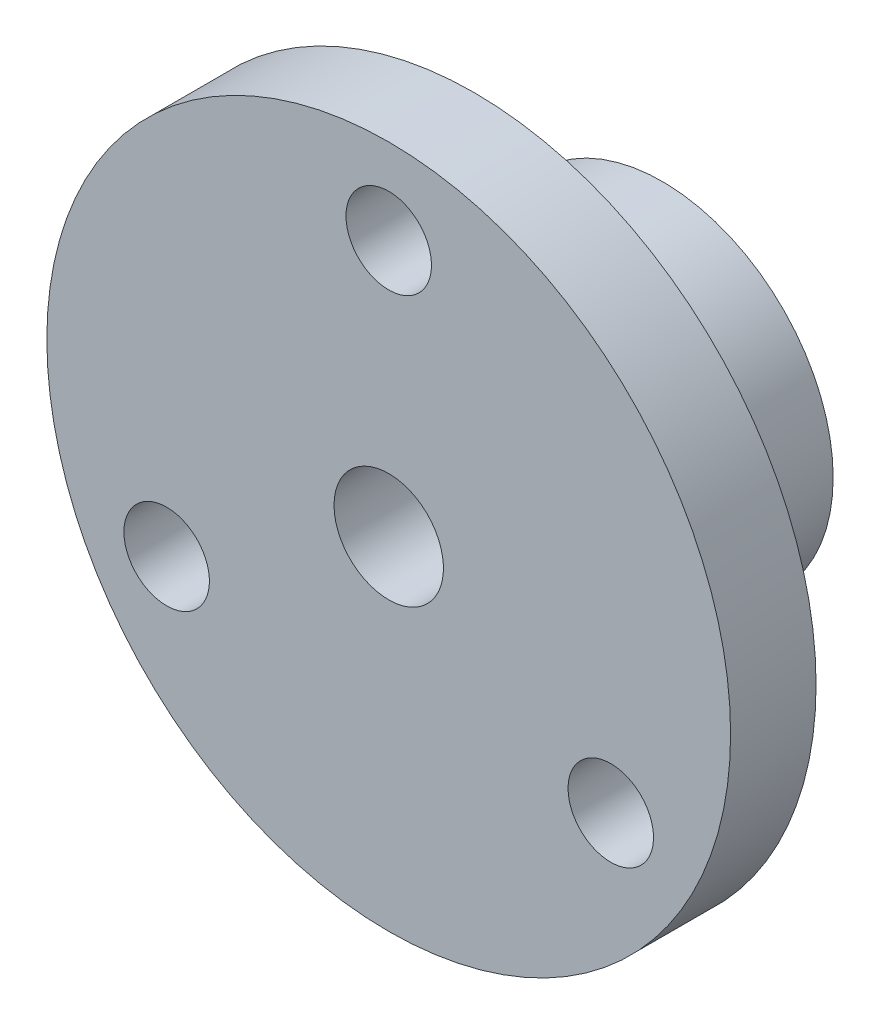
ISO-10303-21;
HEADER;
FILE_DESCRIPTION(('STEP AP214'),'2;1');
FILE_NAME('part.step','',(''),(''),'','','');
FILE_SCHEMA(('AUTOMOTIVE_DESIGN { 1 0 10303 214 1 1 1 1 }'));
ENDSEC;
DATA;
#1=APPLICATION_CONTEXT('core data for automotive mechanical design processes');
#2=APPLICATION_PROTOCOL_DEFINITION('international standard','automotive_design',2000,#1);
#3=PRODUCT_CONTEXT('',#1,'mechanical');
#4=PRODUCT('Part','Part','',(#3));
#5=PRODUCT_RELATED_PRODUCT_CATEGORY('part','',(#4));
#6=PRODUCT_DEFINITION_FORMATION('','',#4);
#7=PRODUCT_DEFINITION_CONTEXT('part definition',#1,'design');
#8=PRODUCT_DEFINITION('design','',#6,#7);
#9=PRODUCT_DEFINITION_SHAPE('','',#8);
#10=(LENGTH_UNIT() NAMED_UNIT(*) SI_UNIT(.MILLI.,.METRE.));
#11=(NAMED_UNIT(*) PLANE_ANGLE_UNIT() SI_UNIT($,.RADIAN.));
#12=(NAMED_UNIT(*) SI_UNIT($,.STERADIAN.) SOLID_ANGLE_UNIT());
#13=UNCERTAINTY_MEASURE_WITH_UNIT(LENGTH_MEASURE(1.E-05),#10,'distance_accuracy_value','');
#14=(GEOMETRIC_REPRESENTATION_CONTEXT(3) GLOBAL_UNCERTAINTY_ASSIGNED_CONTEXT((#13)) GLOBAL_UNIT_ASSIGNED_CONTEXT((#10,
#11,#12)) REPRESENTATION_CONTEXT('',''));
#15=CARTESIAN_POINT('',(0.,0.,0.));
#16=DIRECTION('',(0.,0.,1.));
#17=DIRECTION('',(1.,0.,0.));
#18=AXIS2_PLACEMENT_3D('',#15,#16,#17);
#19=CARTESIAN_POINT('',(0.,12.7,13.97));
#20=DIRECTION('',(0.,0.,1.));
#21=DIRECTION('',(1.,0.,0.));
#22=AXIS2_PLACEMENT_3D('',#19,#20,#21);
#23=PLANE('',#22);
#24=CARTESIAN_POINT('',(16.4977839420936,-9.52499999999985,13.97));
#25=DIRECTION('',(0.,0.,-1.));
#26=DIRECTION('',(-1.,0.,0.));
#27=AXIS2_PLACEMENT_3D('',#24,#25,#26);
#28=CIRCLE('',#27,3.175);
#29=CARTESIAN_POINT('',(13.3227839420936,-9.52499999999985,13.97));
#30=VERTEX_POINT('',#29);
#31=EDGE_CURVE('E167',#30,#30,#28,.T.);
#32=ORIENTED_EDGE('',*,*,#31,.F.);
#33=EDGE_LOOP('',(#32));
#34=FACE_BOUND('',#33,.T.);
#35=CARTESIAN_POINT('',(-16.4977839420935,-9.52500000000008,13.97));
#36=DIRECTION('',(0.,0.,-1.));
#37=DIRECTION('',(-1.,0.,0.));
#38=AXIS2_PLACEMENT_3D('',#35,#36,#37);
#39=CIRCLE('',#38,3.175);
#40=CARTESIAN_POINT('',(-19.6727839420935,-9.52500000000008,13.97));
#41=VERTEX_POINT('',#40);
#42=EDGE_CURVE('E170',#41,#41,#39,.T.);
#43=ORIENTED_EDGE('',*,*,#42,.F.);
#44=EDGE_LOOP('',(#43));
#45=FACE_BOUND('',#44,.T.);
#46=CARTESIAN_POINT('',(0.,0.,13.97));
#47=DIRECTION('',(0.,0.,1.));
#48=DIRECTION('',(1.,0.,0.));
#49=AXIS2_PLACEMENT_3D('',#46,#47,#48);
#50=CIRCLE('',#49,25.4);
#51=CARTESIAN_POINT('',(25.4,0.,13.97));
#52=VERTEX_POINT('',#51);
#53=EDGE_CURVE('E87',#52,#52,#50,.T.);
#54=ORIENTED_EDGE('',*,*,#53,.F.);
#55=EDGE_LOOP('',(#54));
#56=FACE_BOUND('',#55,.T.);
#57=CARTESIAN_POINT('',(0.,0.,13.97));
#58=DIRECTION('',(0.,0.,1.));
#59=DIRECTION('',(1.,0.,0.));
#60=AXIS2_PLACEMENT_3D('',#57,#58,#59);
#61=CIRCLE('',#60,12.7);
#62=CARTESIAN_POINT('',(12.7,0.,13.97));
#63=VERTEX_POINT('',#62);
#64=EDGE_CURVE('E46',#63,#63,#61,.T.);
#65=ORIENTED_EDGE('',*,*,#64,.T.);
#66=EDGE_LOOP('',(#65));
#67=FACE_BOUND('',#66,.T.);
#68=CARTESIAN_POINT('',(0.,19.05,13.97));
#69=DIRECTION('',(0.,0.,-1.));
#70=DIRECTION('',(-1.,0.,0.));
#71=AXIS2_PLACEMENT_3D('',#68,#69,#70);
#72=CIRCLE('',#71,3.175);
#73=CARTESIAN_POINT('',(-3.175,19.05,13.97));
#74=VERTEX_POINT('',#73);
#75=EDGE_CURVE('E177',#74,#74,#72,.T.);
#76=ORIENTED_EDGE('',*,*,#75,.F.);
#77=EDGE_LOOP('',(#76));
#78=FACE_BOUND('',#77,.T.);
#79=ADVANCED_FACE('F34',(#34,#45,#56,#67,#78),#23,.F.);
#80=CARTESIAN_POINT('',(0.,0.,0.));
#81=DIRECTION('',(0.,0.,1.));
#82=DIRECTION('',(1.,0.,0.));
#83=AXIS2_PLACEMENT_3D('',#80,#81,#82);
#84=PLANE('',#83);
#85=CARTESIAN_POINT('',(0.,0.,0.));
#86=DIRECTION('',(0.,0.,-1.));
#87=DIRECTION('',(-1.,0.,0.));
#88=AXIS2_PLACEMENT_3D('',#85,#86,#87);
#89=CIRCLE('',#88,4.064);
#90=CARTESIAN_POINT('',(-4.064,0.,0.));
#91=VERTEX_POINT('',#90);
#92=EDGE_CURVE('E76',#91,#91,#89,.T.);
#93=ORIENTED_EDGE('',*,*,#92,.F.);
#94=EDGE_LOOP('',(#93));
#95=FACE_BOUND('',#94,.T.);
#96=CARTESIAN_POINT('',(0.,0.,0.));
#97=DIRECTION('',(0.,0.,1.));
#98=DIRECTION('',(1.,0.,0.));
#99=AXIS2_PLACEMENT_3D('',#96,#97,#98);
#100=CIRCLE('',#99,12.7);
#101=CARTESIAN_POINT('',(12.7,0.,0.));
#102=VERTEX_POINT('',#101);
#103=EDGE_CURVE('E42',#102,#102,#100,.T.);
#104=ORIENTED_EDGE('',*,*,#103,.F.);
#105=EDGE_LOOP('',(#104));
#106=FACE_BOUND('',#105,.T.);
#107=ADVANCED_FACE('F36',(#95,#106),#84,.F.);
#108=CARTESIAN_POINT('',(0.,0.,20.32));
#109=DIRECTION('',(0.,0.,1.));
#110=DIRECTION('',(1.,0.,0.));
#111=AXIS2_PLACEMENT_3D('',#108,#109,#110);
#112=CYLINDRICAL_SURFACE('',#111,12.7);
#113=CARTESIAN_POINT('',(0.,12.7,10.1727));
#114=CARTESIAN_POINT('',(-0.141856210556825,12.6999973836125,10.1726947992652));
#115=CARTESIAN_POINT('',(-0.283778014555,12.6975988645737,10.1608354019713));
#116=CARTESIAN_POINT('',(-0.563609069212324,12.6882620663431,10.1137494200947));
#117=CARTESIAN_POINT('',(-0.701515058540076,12.6813201991963,10.0785043671802));
#118=CARTESIAN_POINT('',(-0.969228227666429,12.6636717493926,9.98578066346249));
#119=CARTESIAN_POINT('',(-1.09904306188462,12.6529687904705,9.92832340834479));
#120=CARTESIAN_POINT('',(-1.34718134295211,12.6289612418531,9.79287010684562));
#121=CARTESIAN_POINT('',(-1.46550545353773,12.6156568025605,9.71487524774063));
#122=CARTESIAN_POINT('',(-1.68892996901581,12.5877068517561,9.5394303316011));
#123=CARTESIAN_POINT('',(-1.79385064772143,12.5730469098802,9.44175367449849));
#124=CARTESIAN_POINT('',(-1.98593364961853,12.5441430340592,9.23020492459758));
#125=CARTESIAN_POINT('',(-2.07309457629733,12.5298991329043,9.11633155938893));
#126=CARTESIAN_POINT('',(-2.22795031612871,12.503299099816,8.87432720751565));
#127=CARTESIAN_POINT('',(-2.29545876345371,12.4909615307886,8.74607474653988));
#128=CARTESIAN_POINT('',(-2.40789922201016,12.4697761123132,8.47975828311161));
#129=CARTESIAN_POINT('',(-2.45283348724066,12.4609279144755,8.34169526180115));
#130=CARTESIAN_POINT('',(-2.5182660618401,12.4478691093208,8.06161128082188));
#131=CARTESIAN_POINT('',(-2.53907984994945,12.4435986847958,7.91966686859015));
#132=CARTESIAN_POINT('',(-2.556660601318,12.4399989112979,7.63424142085903));
#133=CARTESIAN_POINT('',(-2.55343004860283,12.4406690519141,7.49076054562121));
#134=CARTESIAN_POINT('',(-2.52326882881563,12.4468203533509,7.20864507746523));
#135=CARTESIAN_POINT('',(-2.49670006112813,12.4522280468367,7.06996995253714));
#136=CARTESIAN_POINT('',(-2.42118795375881,12.4671294390268,6.79908634572997));
#137=CARTESIAN_POINT('',(-2.37224353587668,12.4766233346287,6.66687817580956));
#138=CARTESIAN_POINT('',(-2.25302460013362,12.4987023805749,6.41163974605984));
#139=CARTESIAN_POINT('',(-2.1826068594509,12.5113081757149,6.28867824381082));
#140=CARTESIAN_POINT('',(-2.02254121619102,12.538177441116,6.05618120294331));
#141=CARTESIAN_POINT('',(-1.93289108233262,12.5524411036294,5.94664722446258));
#142=CARTESIAN_POINT('',(-1.73496896015373,12.5813370668157,5.74202649623286));
#143=CARTESIAN_POINT('',(-1.62638815322406,12.5959713559519,5.64723848400961));
#144=CARTESIAN_POINT('',(-1.39471255482945,12.6237223479193,5.4771741129816));
#145=CARTESIAN_POINT('',(-1.27161757365897,12.6368390309105,5.40189800924571));
#146=CARTESIAN_POINT('',(-1.0140743227451,12.6601096493237,5.27293805549064));
#147=CARTESIAN_POINT('',(-0.879608370826796,12.6702588568104,5.21928861124457));
#148=CARTESIAN_POINT('',(-0.603322484554133,12.6864151381535,5.13542478103024));
#149=CARTESIAN_POINT('',(-0.46150345240397,12.6924227188899,5.10520752721734));
#150=CARTESIAN_POINT('',(-0.177104051498394,12.6995481841004,5.06948937059479));
#151=CARTESIAN_POINT('',(-0.0345769867780893,12.7007469316581,5.06357967977513));
#152=CARTESIAN_POINT('',(0.249428046087237,12.6983443714293,5.07554312286463));
#153=CARTESIAN_POINT('',(0.390906073365955,12.6947433363045,5.09341490581701));
#154=CARTESIAN_POINT('',(0.667476383491518,12.6831964518339,5.15209439655504));
#155=CARTESIAN_POINT('',(0.802615026738495,12.6752903990727,5.19269211540685));
#156=CARTESIAN_POINT('',(1.06416673072534,12.6560168288592,5.29544140597515));
#157=CARTESIAN_POINT('',(1.19057913200878,12.644649050149,5.35759460454112));
#158=CARTESIAN_POINT('',(1.4328122519913,12.6195117376563,5.5025732272068));
#159=CARTESIAN_POINT('',(1.54848289391928,12.6057142777796,5.58564445783981));
#160=CARTESIAN_POINT('',(1.7643891970181,12.5773133106478,5.76977220929368));
#161=CARTESIAN_POINT('',(1.8646231833638,12.562709716163,5.87083067910883));
#162=CARTESIAN_POINT('',(2.04839058950708,12.5340694771794,6.0899259572378));
#163=CARTESIAN_POINT('',(2.13164324412743,12.5200450170782,6.20820012825238));
#164=CARTESIAN_POINT('',(2.27710130686918,12.494410233843,6.45729396880251));
#165=CARTESIAN_POINT('',(2.33930756146904,12.4827998136245,6.58811313351136));
#166=CARTESIAN_POINT('',(2.44052494151928,12.4634063332917,6.85792170155931));
#167=CARTESIAN_POINT('',(2.47965694875249,12.4556033644444,6.99686425725031));
#168=CARTESIAN_POINT('',(2.53398105268389,12.4446663941807,7.27952630312433));
#169=CARTESIAN_POINT('',(2.54917630665989,12.4415317770077,7.42324516075521));
#170=CARTESIAN_POINT('',(2.55507780348404,12.4403208492062,7.70856063599526));
#171=CARTESIAN_POINT('',(2.54622777717105,12.4421528827854,7.85014787254122));
#172=CARTESIAN_POINT('',(2.5052699101022,12.4504639175017,8.12977122809858));
#173=CARTESIAN_POINT('',(2.47316226034211,12.4569428804773,8.26780737626251));
#174=CARTESIAN_POINT('',(2.38679936908456,12.4737765848225,8.53612427958113));
#175=CARTESIAN_POINT('',(2.33259906402888,12.4841217071844,8.66642335982881));
#176=CARTESIAN_POINT('',(2.20364056330041,12.5075274993734,8.9161477072286));
#177=CARTESIAN_POINT('',(2.12888062178004,12.5205883997912,9.0355720497917));
#178=CARTESIAN_POINT('',(1.95941169836469,12.5482342158997,9.26236530272103));
#179=CARTESIAN_POINT('',(1.86438247968974,12.5628414330946,9.36949224475886));
#180=CARTESIAN_POINT('',(1.65773305497647,12.5917744882506,9.56642595254524));
#181=CARTESIAN_POINT('',(1.54610904069973,12.6061002607682,9.65622873178011));
#182=CARTESIAN_POINT('',(1.30801795412702,12.6330352312072,9.81686358989424));
#183=CARTESIAN_POINT('',(1.18140621960531,12.6456246451832,9.88748471011875));
#184=CARTESIAN_POINT('',(0.917894136535644,12.6674735086059,10.0063360028624));
#185=CARTESIAN_POINT('',(0.781003157818663,12.676735947189,10.0545862859573));
#186=CARTESIAN_POINT('',(0.536510950989498,12.6890953080047,10.1180196258905));
#187=CARTESIAN_POINT('',(0.430298188022949,12.6931605653143,10.138488077794));
#188=CARTESIAN_POINT('',(0.216069596903569,12.6986138643494,10.1658300250375));
#189=CARTESIAN_POINT('',(0.108053827366591,12.7000019929384,10.1727039614712));
#190=CARTESIAN_POINT('',(0.,12.7,10.1727));
#191=B_SPLINE_CURVE_WITH_KNOTS('',3,(#113,#114,#115,#116,#117,#118,#119,#120,#121,#122,#123,
#124,#125,#126,#127,#128,#129,#130,#131,#132,#133,#134,#135,#136,#137,#138,#139,#140,#141,#142,
#143,#144,#145,#146,#147,#148,#149,#150,#151,#152,#153,#154,#155,#156,#157,#158,#159,#160,#161,
#162,#163,#164,#165,#166,#167,#168,#169,#170,#171,#172,#173,#174,#175,#176,#177,#178,#179,#180,
#181,#182,#183,#184,#185,#186,#187,#188,#189,#190),.UNSPECIFIED.,.T.,.F.,(4,2,2,2,2,2,2,2,2,2,2,
2,2,2,2,2,2,2,2,2,2,2,2,2,2,2,2,2,2,2,2,2,2,2,2,2,2,2,4),(0.,0.425173326858357,
0.850682825726687,1.27578347391371,1.70085955247508,2.13114227989732,2.56145882893966,
2.99573225362804,3.42996230812812,3.85844645262254,4.28688633094917,4.70879751785866,
5.13072903726017,5.55553870266189,5.98039767981271,6.4129779320771,6.84556383894967,
7.27883525459766,7.7120536341753,8.13795588808111,8.56383394874414,8.98584032623796,
9.40787856061102,9.83512862114265,10.2624250042595,10.6962975397843,11.1301526230407,
11.5617141464938,11.9932187418526,12.416814710791,12.8404072011225,13.2629527342799,
13.6855341595118,14.1153652704349,14.545295173375,14.9797777811894,15.4138690438583,
15.7377399254777,16.0616002984631),.UNSPECIFIED.);
#192=CARTESIAN_POINT('',(0.,12.7,10.1727));
#193=VERTEX_POINT('',#192);
#194=EDGE_CURVE('E10',#193,#193,#191,.T.);
#195=ORIENTED_EDGE('',*,*,#194,.T.);
#196=EDGE_LOOP('',(#195));
#197=FACE_BOUND('',#196,.T.);
#198=ORIENTED_EDGE('',*,*,#64,.F.);
#199=EDGE_LOOP('',(#198));
#200=FACE_BOUND('',#199,.T.);
#201=ORIENTED_EDGE('',*,*,#103,.T.);
#202=EDGE_LOOP('',(#201));
#203=FACE_BOUND('',#202,.T.);
#204=ADVANCED_FACE('F53',(#197,#200,#203),#112,.T.);
#205=CARTESIAN_POINT('',(0.,0.,20.32));
#206=DIRECTION('',(0.,0.,1.));
#207=DIRECTION('',(1.,0.,0.));
#208=AXIS2_PLACEMENT_3D('',#205,#206,#207);
#209=CYLINDRICAL_SURFACE('',#208,25.4);
#210=CARTESIAN_POINT('',(0.,0.,20.32));
#211=DIRECTION('',(0.,0.,1.));
#212=DIRECTION('',(1.,0.,0.));
#213=AXIS2_PLACEMENT_3D('',#210,#211,#212);
#214=CIRCLE('',#213,25.4);
#215=CARTESIAN_POINT('',(25.4,0.,20.32));
#216=VERTEX_POINT('',#215);
#217=EDGE_CURVE('E82',#216,#216,#214,.T.);
#218=ORIENTED_EDGE('',*,*,#217,.F.);
#219=EDGE_LOOP('',(#218));
#220=FACE_BOUND('',#219,.T.);
#221=ORIENTED_EDGE('',*,*,#53,.T.);
#222=EDGE_LOOP('',(#221));
#223=FACE_BOUND('',#222,.T.);
#224=ADVANCED_FACE('F96',(#220,#223),#209,.T.);
#225=CARTESIAN_POINT('',(0.,25.4,20.32));
#226=DIRECTION('',(0.,0.,-1.));
#227=DIRECTION('',(-1.,0.,0.));
#228=AXIS2_PLACEMENT_3D('',#225,#226,#227);
#229=PLANE('',#228);
#230=CARTESIAN_POINT('',(16.4977839420936,-9.52499999999985,20.32));
#231=DIRECTION('',(0.,0.,-1.));
#232=DIRECTION('',(-1.,0.,0.));
#233=AXIS2_PLACEMENT_3D('',#230,#231,#232);
#234=CIRCLE('',#233,3.175);
#235=CARTESIAN_POINT('',(13.3227839420936,-9.52499999999985,20.32));
#236=VERTEX_POINT('',#235);
#237=EDGE_CURVE('E38',#236,#236,#234,.T.);
#238=ORIENTED_EDGE('',*,*,#237,.T.);
#239=EDGE_LOOP('',(#238));
#240=FACE_BOUND('',#239,.T.);
#241=CARTESIAN_POINT('',(-16.4977839420935,-9.52500000000008,20.32));
#242=DIRECTION('',(0.,0.,-1.));
#243=DIRECTION('',(-1.,0.,0.));
#244=AXIS2_PLACEMENT_3D('',#241,#242,#243);
#245=CIRCLE('',#244,3.175);
#246=CARTESIAN_POINT('',(-19.6727839420935,-9.52500000000008,20.32));
#247=VERTEX_POINT('',#246);
#248=EDGE_CURVE('E172',#247,#247,#245,.T.);
#249=ORIENTED_EDGE('',*,*,#248,.T.);
#250=EDGE_LOOP('',(#249));
#251=FACE_BOUND('',#250,.T.);
#252=CARTESIAN_POINT('',(0.,19.05,20.32));
#253=DIRECTION('',(0.,0.,-1.));
#254=DIRECTION('',(-1.,0.,0.));
#255=AXIS2_PLACEMENT_3D('',#252,#253,#254);
#256=CIRCLE('',#255,3.175);
#257=CARTESIAN_POINT('',(-3.175,19.05,20.32));
#258=VERTEX_POINT('',#257);
#259=EDGE_CURVE('E77',#258,#258,#256,.T.);
#260=ORIENTED_EDGE('',*,*,#259,.T.);
#261=EDGE_LOOP('',(#260));
#262=FACE_BOUND('',#261,.T.);
#263=CARTESIAN_POINT('',(0.,0.,20.32));
#264=DIRECTION('',(0.,0.,-1.));
#265=DIRECTION('',(-1.,0.,0.));
#266=AXIS2_PLACEMENT_3D('',#263,#264,#265);
#267=CIRCLE('',#266,4.064);
#268=CARTESIAN_POINT('',(-4.064,0.,20.32));
#269=VERTEX_POINT('',#268);
#270=EDGE_CURVE('E79',#269,#269,#267,.T.);
#271=ORIENTED_EDGE('',*,*,#270,.T.);
#272=EDGE_LOOP('',(#271));
#273=FACE_BOUND('',#272,.T.);
#274=ORIENTED_EDGE('',*,*,#217,.T.);
#275=EDGE_LOOP('',(#274));
#276=FACE_BOUND('',#275,.T.);
#277=ADVANCED_FACE('F108',(#240,#251,#262,#273,#276),#229,.F.);
#278=CARTESIAN_POINT('',(0.,0.,20.32));
#279=DIRECTION('',(0.,0.,-1.));
#280=DIRECTION('',(-1.,0.,0.));
#281=AXIS2_PLACEMENT_3D('',#278,#279,#280);
#282=CYLINDRICAL_SURFACE('',#281,4.064);
#283=CARTESIAN_POINT('',(0.,4.064,10.1727));
#284=CARTESIAN_POINT('',(0.129583560207723,4.06399007982436,10.1726891701585));
#285=CARTESIAN_POINT('',(0.25932069082056,4.05773712727018,10.1627654572209));
#286=CARTESIAN_POINT('',(0.514802945475129,4.03331452654215,10.1236037305362));
#287=CARTESIAN_POINT('',(0.640540306193337,4.01512302925942,10.0943303035552));
#288=CARTESIAN_POINT('',(0.883834087628374,3.96865220766853,10.0181836508505));
#289=CARTESIAN_POINT('',(1.00142761601026,3.94042280961316,9.97139747000487));
#290=CARTESIAN_POINT('',(1.22668209947551,3.87622040165628,9.86214541670988));
#291=CARTESIAN_POINT('',(1.33434399232919,3.84024812392853,9.79968102671355));
#292=CARTESIAN_POINT('',(1.5464513114228,3.76011228899801,9.65531915637628));
#293=CARTESIAN_POINT('',(1.64994497457365,3.71552301086156,9.57226431095946));
#294=CARTESIAN_POINT('',(1.84245601092692,3.62392652117943,9.39174489689971));
#295=CARTESIAN_POINT('',(1.93145347677835,3.57691609933222,9.29426085757315));
#296=CARTESIAN_POINT('',(2.1048659669456,3.47805856509155,9.07200939101783));
#297=CARTESIAN_POINT('',(2.18698065437821,3.42643176157548,8.94533377563654));
#298=CARTESIAN_POINT('',(2.32852218103917,3.33186817630684,8.67696418777553));
#299=CARTESIAN_POINT('',(2.38798747567637,3.28891672383998,8.53529619766088));
#300=CARTESIAN_POINT('',(2.46893139227093,3.22836369614783,8.27858062355641));
#301=CARTESIAN_POINT('',(2.49627722210726,3.20707021832187,8.16625981788558));
#302=CARTESIAN_POINT('',(2.53553332769022,3.17613168422398,7.93744838670402));
#303=CARTESIAN_POINT('',(2.54746574572368,3.16646991966188,7.82096399038959));
#304=CARTESIAN_POINT('',(2.55517781455129,3.16025219647761,7.58677969204879));
#305=CARTESIAN_POINT('',(2.55091360459986,3.16373182482722,7.46907735150694));
#306=CARTESIAN_POINT('',(2.52642608536961,3.18331517706814,7.23638465601101));
#307=CARTESIAN_POINT('',(2.50618989926687,3.19942908681924,7.12139656639341));
#308=CARTESIAN_POINT('',(2.45160655618932,3.24142801023926,6.89984576157925));
#309=CARTESIAN_POINT('',(2.41761318843319,3.26706680978686,6.79314640827543));
#310=CARTESIAN_POINT('',(2.33687277523268,3.3252959869964,6.5867534888306));
#311=CARTESIAN_POINT('',(2.29012123525211,3.35788881358616,6.48706240720575));
#312=CARTESIAN_POINT('',(2.17508297696241,3.43375839712656,6.27756190591384));
#313=CARTESIAN_POINT('',(2.10439914493049,3.47789141750363,6.16937987392019));
#314=CARTESIAN_POINT('',(1.94795705030606,3.56787279308378,5.96521862933877));
#315=CARTESIAN_POINT('',(1.86218318517808,3.61372288467257,5.86925222600773));
#316=CARTESIAN_POINT('',(1.66097973341888,3.71103024465745,5.67576415780571));
#317=CARTESIAN_POINT('',(1.54298852817698,3.76213128234563,5.58070279634258));
#318=CARTESIAN_POINT('',(1.28963817473908,3.8563075367829,5.41178791164884));
#319=CARTESIAN_POINT('',(1.15428549621785,3.89938572862092,5.33792652137316));
#320=CARTESIAN_POINT('',(0.944601754779722,3.95331661392603,5.24735893732947));
#321=CARTESIAN_POINT('',(0.875593248701045,3.96920586697513,5.22101748876259));
#322=CARTESIAN_POINT('',(0.734943901750412,3.99763504414201,5.17426587778901));
#323=CARTESIAN_POINT('',(0.663304614182558,4.01017690962133,5.15385227684164));
#324=CARTESIAN_POINT('',(0.518045763445456,4.03151416398274,5.11930562149753));
#325=CARTESIAN_POINT('',(0.444428085214783,4.04031299332595,5.10516679903595));
#326=CARTESIAN_POINT('',(0.295900310662177,4.05390085744297,5.08339548254097));
#327=CARTESIAN_POINT('',(0.22099044278698,4.05869059371922,5.07576185023925));
#328=CARTESIAN_POINT('',(0.0180499082181783,4.06595961445425,5.06417038029368));
#329=CARTESIAN_POINT('',(-0.110561794518703,4.06449246850702,5.06649763260625));
#330=CARTESIAN_POINT('',(-0.365192837875257,4.04957195844443,5.09031766826657));
#331=CARTESIAN_POINT('',(-0.491212373261511,4.03611949825505,5.11180900626935));
#332=CARTESIAN_POINT('',(-0.732034154261933,3.99930687678727,5.17149818902477));
#333=CARTESIAN_POINT('',(-0.847084593667885,3.97637711913557,5.20897229946203));
#334=CARTESIAN_POINT('',(-1.06912821416779,3.92251599839021,5.29887833256591));
#335=CARTESIAN_POINT('',(-1.17612006730173,3.89158332021806,5.35131271372205));
#336=CARTESIAN_POINT('',(-1.39068651952767,3.82048542610851,5.47543967262623));
#337=CARTESIAN_POINT('',(-1.49724104672277,3.77970505749761,5.54853726168904));
#338=CARTESIAN_POINT('',(-1.69730896898412,3.69419849095681,5.70900628403897));
#339=CARTESIAN_POINT('',(-1.79080780781617,3.64946797812651,5.79639341733398));
#340=CARTESIAN_POINT('',(-1.97636294543095,3.55282391699373,5.99775576494357));
#341=CARTESIAN_POINT('',(-2.06619056268971,3.50082026314575,6.11375095969797));
#342=CARTESIAN_POINT('',(-2.22544596643977,3.40180531674413,6.36093439269839));
#343=CARTESIAN_POINT('',(-2.2948868214027,3.35479083839075,6.49211282254261));
#344=CARTESIAN_POINT('',(-2.39877121982759,3.28103367996309,6.73899270240239));
#345=CARTESIAN_POINT('',(-2.43749074761558,3.25210840368696,6.85223272213285));
#346=CARTESIAN_POINT('',(-2.49891710686905,3.205155834585,7.08508282472356));
#347=CARTESIAN_POINT('',(-2.52164922805352,3.18711133645183,7.20468252364109));
#348=CARTESIAN_POINT('',(-2.54985188287624,3.16460188155455,7.44796244455226));
#349=CARTESIAN_POINT('',(-2.55521888591462,3.16021837713017,7.57166271446709));
#350=CARTESIAN_POINT('',(-2.54798083061183,3.16605514285317,7.81820995109138));
#351=CARTESIAN_POINT('',(-2.53537049617132,3.17627970026612,7.94105665665743));
#352=CARTESIAN_POINT('',(-2.49490306934124,3.20813439716273,8.17161651822828));
#353=CARTESIAN_POINT('',(-2.46843075317375,3.22872293401971,8.27972921953353));
#354=CARTESIAN_POINT('',(-2.40244041634075,3.27811946990378,8.48988616380289));
#355=CARTESIAN_POINT('',(-2.36291682970379,3.30693097506513,8.59192779568966));
#356=CARTESIAN_POINT('',(-2.26551499436121,3.37454058614559,8.80282759543777));
#357=CARTESIAN_POINT('',(-2.20581973289595,3.41417773669753,8.91057224715518));
#358=CARTESIAN_POINT('',(-2.07233318779454,3.49681290138571,9.11555710557624));
#359=CARTESIAN_POINT('',(-1.99853062358031,3.53981358872861,9.21278880776303));
#360=CARTESIAN_POINT('',(-1.82156053726959,3.63455935931143,9.41433731887261));
#361=CARTESIAN_POINT('',(-1.71547294054463,3.68631250368386,9.51610405603615));
#362=CARTESIAN_POINT('',(-1.48574397446782,3.78473790505161,9.7009953091479));
#363=CARTESIAN_POINT('',(-1.36209117001789,3.83140681692043,9.78410758922611));
#364=CARTESIAN_POINT('',(-1.16491477849696,3.894085479889,9.8926525575962));
#365=CARTESIAN_POINT('',(-1.09695767052832,3.91381871904773,9.92624395643086));
#366=CARTESIAN_POINT('',(-0.957644443785922,3.95021295474601,9.9874825355731));
#367=CARTESIAN_POINT('',(-0.886290308279581,3.9668757168853,10.0151331335149));
#368=CARTESIAN_POINT('',(-0.740905106726464,3.99657950742978,10.0640139273054));
#369=CARTESIAN_POINT('',(-0.66688175371446,4.00963015283918,10.0852611852775));
#370=CARTESIAN_POINT('',(-0.516691068443876,4.03173412091009,10.1210517873365));
#371=CARTESIAN_POINT('',(-0.440525333342384,4.04079034159801,10.1355999920444));
#372=CARTESIAN_POINT('',(-0.303627282258303,4.05309038858326,10.1553043170979));
#373=CARTESIAN_POINT('',(-0.243162590963506,4.05717222205353,10.1618186383072));
#374=CARTESIAN_POINT('',(-0.121809931204748,4.06262944175182,10.1705191567587));
#375=CARTESIAN_POINT('',(-0.0609219372938981,4.06400466383481,10.1727050915018));
#376=CARTESIAN_POINT('',(0.,4.064,10.1727));
#377=B_SPLINE_CURVE_WITH_KNOTS('',3,(#283,#284,#285,#286,#287,#288,#289,#290,#291,#292,#293,
#294,#295,#296,#297,#298,#299,#300,#301,#302,#303,#304,#305,#306,#307,#308,#309,#310,#311,#312,
#313,#314,#315,#316,#317,#318,#319,#320,#321,#322,#323,#324,#325,#326,#327,#328,#329,#330,#331,
#332,#333,#334,#335,#336,#337,#338,#339,#340,#341,#342,#343,#344,#345,#346,#347,#348,#349,#350,
#351,#352,#353,#354,#355,#356,#357,#358,#359,#360,#361,#362,#363,#364,#365,#366,#367,#368,#369,
#370,#371,#372,#373,#374,#375,#376),.UNSPECIFIED.,.T.,.F.,(4,2,2,2,2,2,2,2,2,2,2,2,2,2,2,2,2,2,
2,2,2,2,2,2,2,2,2,2,2,2,2,2,2,2,2,2,2,2,2,2,2,2,2,2,2,2,4),(0.,0.388506354595018,
0.777725717243615,1.16503566352273,1.55230900149751,1.9706665478682,2.38959385919653,
2.86594528298725,3.34148428659311,3.69266544726977,4.04334155210795,4.39496797002053,
4.74687816385032,5.09026157663882,5.43376611539791,5.84192668756482,6.25051178991022,
6.7279124560858,7.20513573510156,7.43150922998073,7.65775114986676,7.88378466480938,
8.1097786206239,8.49352028529016,8.87723301081529,9.24515866190783,9.61314481076024,
10.0180782582648,10.4234596353833,10.888378971533,11.352999627682,11.720915768671,
12.0882486035667,12.4577674748808,12.8273948171899,13.1656528928312,13.5040554120032,
13.8908741660138,14.2780035344984,14.7434990029858,15.2092989136927,15.443997849372,
15.6785614033633,15.9124943058778,16.1462572055948,16.3288970749089,16.5115480202525),.UNSPECIFIED.);
#378=CARTESIAN_POINT('',(0.,4.064,10.1727));
#379=VERTEX_POINT('',#378);
#380=EDGE_CURVE('E69',#379,#379,#377,.T.);
#381=ORIENTED_EDGE('',*,*,#380,.T.);
#382=EDGE_LOOP('',(#381));
#383=FACE_BOUND('',#382,.T.);
#384=ORIENTED_EDGE('',*,*,#270,.F.);
#385=EDGE_LOOP('',(#384));
#386=FACE_BOUND('',#385,.T.);
#387=ORIENTED_EDGE('',*,*,#92,.T.);
#388=EDGE_LOOP('',(#387));
#389=FACE_BOUND('',#388,.T.);
#390=ADVANCED_FACE('F62',(#383,#386,#389),#282,.F.);
#391=CARTESIAN_POINT('',(0.,12.7,7.62));
#392=DIRECTION('',(0.,1.,0.));
#393=DIRECTION('',(0.,0.,1.));
#394=AXIS2_PLACEMENT_3D('',#391,#392,#393);
#395=CYLINDRICAL_SURFACE('',#394,2.5527);
#396=ORIENTED_EDGE('',*,*,#194,.F.);
#397=EDGE_LOOP('',(#396));
#398=FACE_BOUND('',#397,.T.);
#399=ORIENTED_EDGE('',*,*,#380,.F.);
#400=EDGE_LOOP('',(#399));
#401=FACE_BOUND('',#400,.T.);
#402=ADVANCED_FACE('F56',(#398,#401),#395,.F.);
#403=CARTESIAN_POINT('',(0.,19.05,13.97));
#404=DIRECTION('',(0.,0.,-1.));
#405=DIRECTION('',(-1.,0.,0.));
#406=AXIS2_PLACEMENT_3D('',#403,#404,#405);
#407=CYLINDRICAL_SURFACE('',#406,3.175);
#408=ORIENTED_EDGE('',*,*,#75,.T.);
#409=EDGE_LOOP('',(#408));
#410=FACE_BOUND('',#409,.T.);
#411=ORIENTED_EDGE('',*,*,#259,.F.);
#412=EDGE_LOOP('',(#411));
#413=FACE_BOUND('',#412,.T.);
#414=ADVANCED_FACE('F61',(#410,#413),#407,.F.);
#415=CARTESIAN_POINT('',(-16.4977839420935,-9.52500000000008,13.97));
#416=DIRECTION('',(0.,0.,-1.));
#417=DIRECTION('',(-1.,0.,0.));
#418=AXIS2_PLACEMENT_3D('',#415,#416,#417);
#419=CYLINDRICAL_SURFACE('',#418,3.175);
#420=ORIENTED_EDGE('',*,*,#42,.T.);
#421=EDGE_LOOP('',(#420));
#422=FACE_BOUND('',#421,.T.);
#423=ORIENTED_EDGE('',*,*,#248,.F.);
#424=EDGE_LOOP('',(#423));
#425=FACE_BOUND('',#424,.T.);
#426=ADVANCED_FACE('F144',(#422,#425),#419,.F.);
#427=CARTESIAN_POINT('',(16.4977839420936,-9.52499999999985,13.97));
#428=DIRECTION('',(0.,0.,-1.));
#429=DIRECTION('',(-1.,0.,0.));
#430=AXIS2_PLACEMENT_3D('',#427,#428,#429);
#431=CYLINDRICAL_SURFACE('',#430,3.175);
#432=ORIENTED_EDGE('',*,*,#31,.T.);
#433=EDGE_LOOP('',(#432));
#434=FACE_BOUND('',#433,.T.);
#435=ORIENTED_EDGE('',*,*,#237,.F.);
#436=EDGE_LOOP('',(#435));
#437=FACE_BOUND('',#436,.T.);
#438=ADVANCED_FACE('F149',(#434,#437),#431,.F.);
#439=CLOSED_SHELL('',(#79,#107,#204,#224,#277,#390,#402,#414,#426,#438));
#440=MANIFOLD_SOLID_BREP('B2',#439);
#441=ADVANCED_BREP_SHAPE_REPRESENTATION('',(#18,#440),#14);
#442=SHAPE_DEFINITION_REPRESENTATION(#9,#441);
ENDSEC;
END-ISO-10303-21;
